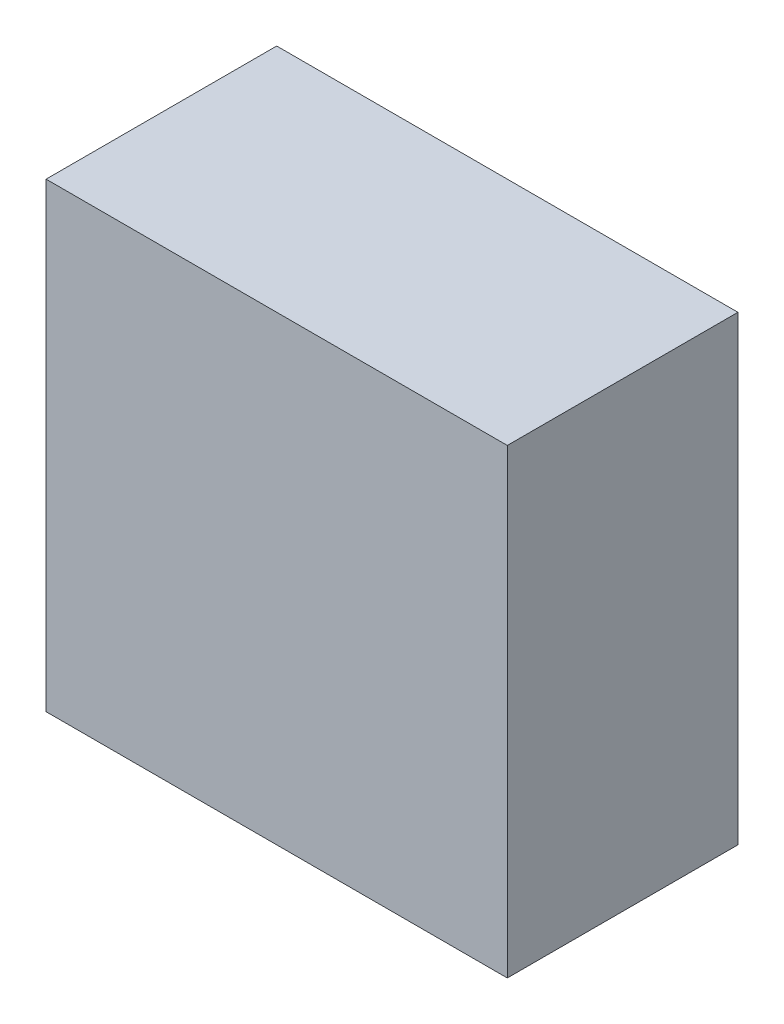
ISO-10303-21;
HEADER;
FILE_DESCRIPTION(('STEP AP214'),'2;1');
FILE_NAME('part.step','',(''),(''),'','','');
FILE_SCHEMA(('AUTOMOTIVE_DESIGN { 1 0 10303 214 1 1 1 1 }'));
ENDSEC;
DATA;
#1=APPLICATION_CONTEXT('core data for automotive mechanical design processes');
#2=APPLICATION_PROTOCOL_DEFINITION('international standard','automotive_design',2000,#1);
#3=PRODUCT_CONTEXT('',#1,'mechanical');
#4=PRODUCT('Part','Part','',(#3));
#5=PRODUCT_RELATED_PRODUCT_CATEGORY('part','',(#4));
#6=PRODUCT_DEFINITION_FORMATION('','',#4);
#7=PRODUCT_DEFINITION_CONTEXT('part definition',#1,'design');
#8=PRODUCT_DEFINITION('design','',#6,#7);
#9=PRODUCT_DEFINITION_SHAPE('','',#8);
#10=(LENGTH_UNIT() NAMED_UNIT(*) SI_UNIT(.MILLI.,.METRE.));
#11=(NAMED_UNIT(*) PLANE_ANGLE_UNIT() SI_UNIT($,.RADIAN.));
#12=(NAMED_UNIT(*) SI_UNIT($,.STERADIAN.) SOLID_ANGLE_UNIT());
#13=UNCERTAINTY_MEASURE_WITH_UNIT(LENGTH_MEASURE(1.E-05),#10,'distance_accuracy_value','');
#14=(GEOMETRIC_REPRESENTATION_CONTEXT(3) GLOBAL_UNCERTAINTY_ASSIGNED_CONTEXT((#13)) GLOBAL_UNIT_ASSIGNED_CONTEXT((#10,
#11,#12)) REPRESENTATION_CONTEXT('',''));
#15=CARTESIAN_POINT('',(0.,0.,0.));
#16=DIRECTION('',(0.,0.,1.));
#17=DIRECTION('',(1.,0.,0.));
#18=AXIS2_PLACEMENT_3D('',#15,#16,#17);
#19=CARTESIAN_POINT('',(0.,0.,2.75));
#20=DIRECTION('',(0.,0.,-1.));
#21=DIRECTION('',(-1.,0.,0.));
#22=AXIS2_PLACEMENT_3D('',#19,#20,#21);
#23=PLANE('',#22);
#24=DIRECTION('',(1.,0.,0.));
#25=VECTOR('',#24,1.);
#26=CARTESIAN_POINT('',(-138.,165.941489418563,2.75));
#27=LINE('',#26,#25);
#28=CARTESIAN_POINT('',(-142.,165.941489418563,2.75));
#29=VERTEX_POINT('',#28);
#30=CARTESIAN_POINT('',(-138.,165.941489418563,2.75));
#31=VERTEX_POINT('',#30);
#32=EDGE_CURVE('E80',#29,#31,#27,.T.);
#33=ORIENTED_EDGE('',*,*,#32,.T.);
#34=DIRECTION('',(0.,1.,0.));
#35=VECTOR('',#34,1.);
#36=CARTESIAN_POINT('',(-138.,169.941489418563,2.75));
#37=LINE('',#36,#35);
#38=CARTESIAN_POINT('',(-138.,169.941489418563,2.75));
#39=VERTEX_POINT('',#38);
#40=EDGE_CURVE('E55',#31,#39,#37,.T.);
#41=ORIENTED_EDGE('',*,*,#40,.T.);
#42=DIRECTION('',(1.,0.,0.));
#43=VECTOR('',#42,1.);
#44=CARTESIAN_POINT('',(-138.,169.941489418563,2.75));
#45=LINE('',#44,#43);
#46=CARTESIAN_POINT('',(-142.,169.941489418563,2.75));
#47=VERTEX_POINT('',#46);
#48=EDGE_CURVE('E57',#39,#47,#45,.F.);
#49=ORIENTED_EDGE('',*,*,#48,.T.);
#50=DIRECTION('',(0.,1.,0.));
#51=VECTOR('',#50,1.);
#52=CARTESIAN_POINT('',(-142.,169.941489418563,2.75));
#53=LINE('',#52,#51);
#54=EDGE_CURVE('E20',#47,#29,#53,.F.);
#55=ORIENTED_EDGE('',*,*,#54,.T.);
#56=EDGE_LOOP('',(#33,#41,#49,#55));
#57=FACE_BOUND('',#56,.T.);
#58=ADVANCED_FACE('F17',(#57),#23,.F.);
#59=CARTESIAN_POINT('',(-142.,169.941489418563,2.75));
#60=DIRECTION('',(1.,0.,0.));
#61=DIRECTION('',(0.,0.,-1.));
#62=AXIS2_PLACEMENT_3D('',#59,#60,#61);
#63=PLANE('',#62);
#64=DIRECTION('',(0.,0.,1.));
#65=VECTOR('',#64,1.);
#66=CARTESIAN_POINT('',(-142.,165.941489418563,2.75));
#67=LINE('',#66,#65);
#68=CARTESIAN_POINT('',(-142.,165.941489418563,0.75));
#69=VERTEX_POINT('',#68);
#70=EDGE_CURVE('E68',#69,#29,#67,.T.);
#71=ORIENTED_EDGE('',*,*,#70,.T.);
#72=ORIENTED_EDGE('',*,*,#54,.F.);
#73=DIRECTION('',(0.,0.,-1.));
#74=VECTOR('',#73,1.);
#75=CARTESIAN_POINT('',(-142.,169.941489418563,2.75));
#76=LINE('',#75,#74);
#77=CARTESIAN_POINT('',(-142.,169.941489418563,0.75));
#78=VERTEX_POINT('',#77);
#79=EDGE_CURVE('E63',#47,#78,#76,.T.);
#80=ORIENTED_EDGE('',*,*,#79,.T.);
#81=DIRECTION('',(0.,1.,0.));
#82=VECTOR('',#81,1.);
#83=CARTESIAN_POINT('',(-142.,0.,0.75));
#84=LINE('',#83,#82);
#85=EDGE_CURVE('E83',#69,#78,#84,.T.);
#86=ORIENTED_EDGE('',*,*,#85,.F.);
#87=EDGE_LOOP('',(#71,#72,#80,#86));
#88=FACE_BOUND('',#87,.T.);
#89=ADVANCED_FACE('F65',(#88),#63,.F.);
#90=CARTESIAN_POINT('',(-138.,169.941489418563,2.75));
#91=DIRECTION('',(0.,-1.,0.));
#92=DIRECTION('',(0.,0.,-1.));
#93=AXIS2_PLACEMENT_3D('',#90,#91,#92);
#94=PLANE('',#93);
#95=ORIENTED_EDGE('',*,*,#79,.F.);
#96=ORIENTED_EDGE('',*,*,#48,.F.);
#97=DIRECTION('',(0.,0.,1.));
#98=VECTOR('',#97,1.);
#99=CARTESIAN_POINT('',(-138.,169.941489418563,2.75));
#100=LINE('',#99,#98);
#101=CARTESIAN_POINT('',(-138.,169.941489418563,0.75));
#102=VERTEX_POINT('',#101);
#103=EDGE_CURVE('E75',#39,#102,#100,.F.);
#104=ORIENTED_EDGE('',*,*,#103,.T.);
#105=DIRECTION('',(-1.,0.,0.));
#106=VECTOR('',#105,1.);
#107=CARTESIAN_POINT('',(0.,169.941489418563,0.75));
#108=LINE('',#107,#106);
#109=EDGE_CURVE('E72',#78,#102,#108,.F.);
#110=ORIENTED_EDGE('',*,*,#109,.F.);
#111=EDGE_LOOP('',(#95,#96,#104,#110));
#112=FACE_BOUND('',#111,.T.);
#113=ADVANCED_FACE('F70',(#112),#94,.F.);
#114=CARTESIAN_POINT('',(-138.,169.941489418563,2.75));
#115=DIRECTION('',(-1.,0.,0.));
#116=DIRECTION('',(0.,0.,1.));
#117=AXIS2_PLACEMENT_3D('',#114,#115,#116);
#118=PLANE('',#117);
#119=ORIENTED_EDGE('',*,*,#103,.F.);
#120=ORIENTED_EDGE('',*,*,#40,.F.);
#121=DIRECTION('',(0.,0.,1.));
#122=VECTOR('',#121,1.);
#123=CARTESIAN_POINT('',(-138.,165.941489418563,2.75));
#124=LINE('',#123,#122);
#125=CARTESIAN_POINT('',(-138.,165.941489418563,0.75));
#126=VERTEX_POINT('',#125);
#127=EDGE_CURVE('E35',#31,#126,#124,.F.);
#128=ORIENTED_EDGE('',*,*,#127,.T.);
#129=DIRECTION('',(0.,1.,0.));
#130=VECTOR('',#129,1.);
#131=CARTESIAN_POINT('',(-138.,0.,0.75));
#132=LINE('',#131,#130);
#133=EDGE_CURVE('E26',#102,#126,#132,.F.);
#134=ORIENTED_EDGE('',*,*,#133,.F.);
#135=EDGE_LOOP('',(#119,#120,#128,#134));
#136=FACE_BOUND('',#135,.T.);
#137=ADVANCED_FACE('F89',(#136),#118,.F.);
#138=CARTESIAN_POINT('',(-138.,165.941489418563,2.75));
#139=DIRECTION('',(0.,1.,0.));
#140=DIRECTION('',(0.,0.,1.));
#141=AXIS2_PLACEMENT_3D('',#138,#139,#140);
#142=PLANE('',#141);
#143=ORIENTED_EDGE('',*,*,#127,.F.);
#144=ORIENTED_EDGE('',*,*,#32,.F.);
#145=ORIENTED_EDGE('',*,*,#70,.F.);
#146=DIRECTION('',(-1.,0.,0.));
#147=VECTOR('',#146,1.);
#148=CARTESIAN_POINT('',(0.,165.941489418563,0.75));
#149=LINE('',#148,#147);
#150=EDGE_CURVE('E11',#126,#69,#149,.T.);
#151=ORIENTED_EDGE('',*,*,#150,.F.);
#152=EDGE_LOOP('',(#143,#144,#145,#151));
#153=FACE_BOUND('',#152,.T.);
#154=ADVANCED_FACE('F91',(#153),#142,.F.);
#155=CARTESIAN_POINT('',(0.,0.,0.75));
#156=DIRECTION('',(0.,0.,-1.));
#157=DIRECTION('',(-1.,0.,0.));
#158=AXIS2_PLACEMENT_3D('',#155,#156,#157);
#159=PLANE('',#158);
#160=ORIENTED_EDGE('',*,*,#133,.T.);
#161=ORIENTED_EDGE('',*,*,#150,.T.);
#162=ORIENTED_EDGE('',*,*,#85,.T.);
#163=ORIENTED_EDGE('',*,*,#109,.T.);
#164=EDGE_LOOP('',(#160,#161,#162,#163));
#165=FACE_BOUND('',#164,.T.);
#166=ADVANCED_FACE('F88',(#165),#159,.T.);
#167=CLOSED_SHELL('',(#58,#89,#113,#137,#154,#166));
#168=MANIFOLD_SOLID_BREP('B1',#167);
#169=ADVANCED_BREP_SHAPE_REPRESENTATION('',(#18,#168),#14);
#170=SHAPE_DEFINITION_REPRESENTATION(#9,#169);
ENDSEC;
END-ISO-10303-21;
